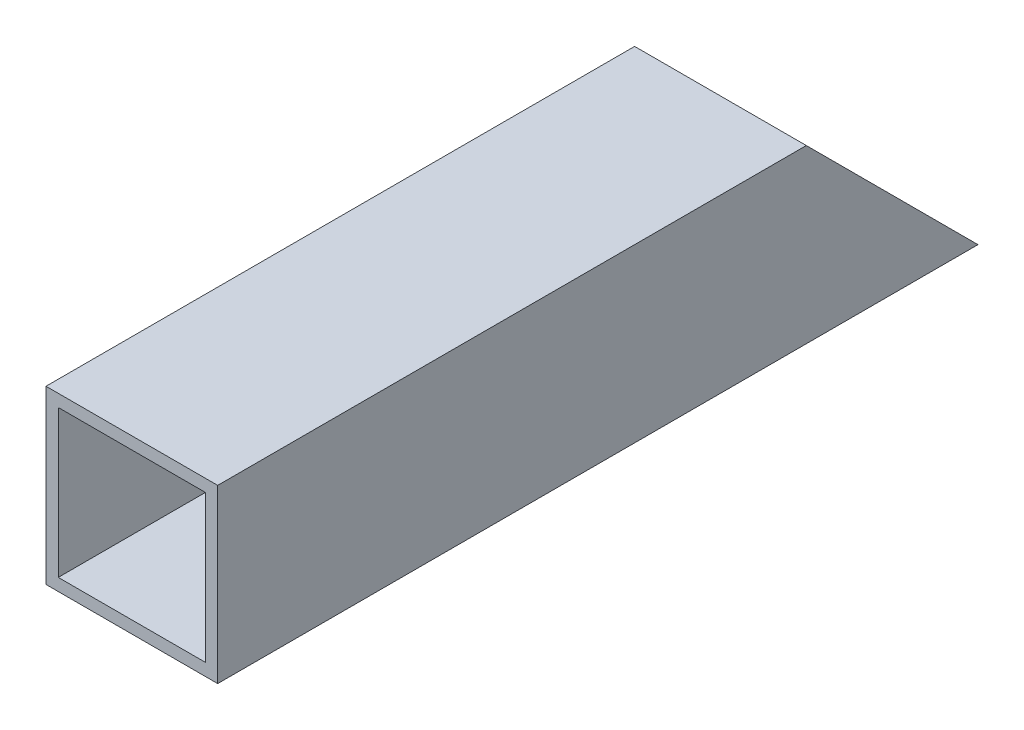
ISO-10303-21;
HEADER;
FILE_DESCRIPTION(('STEP AP214'),'2;1');
FILE_NAME('part.step','',(''),(''),'','','');
FILE_SCHEMA(('AUTOMOTIVE_DESIGN { 1 0 10303 214 1 1 1 1 }'));
ENDSEC;
DATA;
#1=APPLICATION_CONTEXT('core data for automotive mechanical design processes');
#2=APPLICATION_PROTOCOL_DEFINITION('international standard','automotive_design',2000,#1);
#3=PRODUCT_CONTEXT('',#1,'mechanical');
#4=PRODUCT('Part','Part','',(#3));
#5=PRODUCT_RELATED_PRODUCT_CATEGORY('part','',(#4));
#6=PRODUCT_DEFINITION_FORMATION('','',#4);
#7=PRODUCT_DEFINITION_CONTEXT('part definition',#1,'design');
#8=PRODUCT_DEFINITION('design','',#6,#7);
#9=PRODUCT_DEFINITION_SHAPE('','',#8);
#10=(LENGTH_UNIT() NAMED_UNIT(*) SI_UNIT(.MILLI.,.METRE.));
#11=(NAMED_UNIT(*) PLANE_ANGLE_UNIT() SI_UNIT($,.RADIAN.));
#12=(NAMED_UNIT(*) SI_UNIT($,.STERADIAN.) SOLID_ANGLE_UNIT());
#13=UNCERTAINTY_MEASURE_WITH_UNIT(LENGTH_MEASURE(1.E-05),#10,'distance_accuracy_value','');
#14=(GEOMETRIC_REPRESENTATION_CONTEXT(3) GLOBAL_UNCERTAINTY_ASSIGNED_CONTEXT((#13)) GLOBAL_UNIT_ASSIGNED_CONTEXT((#10,
#11,#12)) REPRESENTATION_CONTEXT('',''));
#15=CARTESIAN_POINT('',(0.,0.,0.));
#16=DIRECTION('',(0.,0.,1.));
#17=DIRECTION('',(1.,0.,0.));
#18=AXIS2_PLACEMENT_3D('',#15,#16,#17);
#19=CARTESIAN_POINT('',(-27.4241630678852,-17.7321151335803,0.));
#20=DIRECTION('',(-1.,0.,0.));
#21=DIRECTION('',(0.,0.,1.));
#22=AXIS2_PLACEMENT_3D('',#19,#20,#21);
#23=PLANE('',#22);
#24=DIRECTION('',(0.,1.,0.));
#25=VECTOR('',#24,1.);
#26=CARTESIAN_POINT('',(-27.4241630678852,4.49288486641971,196.85));
#27=LINE('',#26,#25);
#28=CARTESIAN_POINT('',(-27.4241630678852,-14.5571151335803,196.85));
#29=VERTEX_POINT('',#28);
#30=CARTESIAN_POINT('',(-27.4241630678852,23.5428848664197,196.85));
#31=VERTEX_POINT('',#30);
#32=EDGE_CURVE('E117',#29,#31,#27,.T.);
#33=ORIENTED_EDGE('',*,*,#32,.F.);
#34=DIRECTION('',(0.,0.,-1.));
#35=VECTOR('',#34,1.);
#36=CARTESIAN_POINT('',(-27.4241630678852,-14.5571151335803,0.));
#37=LINE('',#36,#35);
#38=CARTESIAN_POINT('',(-27.4241630678852,-14.5571151335803,3.17499999999993));
#39=VERTEX_POINT('',#38);
#40=EDGE_CURVE('E101',#29,#39,#37,.T.);
#41=ORIENTED_EDGE('',*,*,#40,.T.);
#42=DIRECTION('',(0.,-0.707106781186547,-0.707106781186548));
#43=VECTOR('',#42,1.);
#44=CARTESIAN_POINT('',(-27.4241630678852,26.7178848664198,44.45));
#45=LINE('',#44,#43);
#46=CARTESIAN_POINT('',(-27.4241630678852,23.5428848664197,41.275));
#47=VERTEX_POINT('',#46);
#48=EDGE_CURVE('E105',#39,#47,#45,.F.);
#49=ORIENTED_EDGE('',*,*,#48,.T.);
#50=DIRECTION('',(0.,0.,1.));
#51=VECTOR('',#50,1.);
#52=CARTESIAN_POINT('',(-27.4241630678852,23.5428848664197,0.));
#53=LINE('',#52,#51);
#54=EDGE_CURVE('E20',#47,#31,#53,.T.);
#55=ORIENTED_EDGE('',*,*,#54,.T.);
#56=EDGE_LOOP('',(#33,#41,#49,#55));
#57=FACE_BOUND('',#56,.T.);
#58=ADVANCED_FACE('F17',(#57),#23,.F.);
#59=CARTESIAN_POINT('',(-30.5991630678852,23.5428848664197,0.));
#60=DIRECTION('',(0.,1.,0.));
#61=DIRECTION('',(0.,0.,1.));
#62=AXIS2_PLACEMENT_3D('',#59,#60,#61);
#63=PLANE('',#62);
#64=DIRECTION('',(1.,0.,0.));
#65=VECTOR('',#64,1.);
#66=CARTESIAN_POINT('',(-8.3741630678852,23.5428848664197,196.85));
#67=LINE('',#66,#65);
#68=CARTESIAN_POINT('',(10.6758369321148,23.5428848664197,196.85));
#69=VERTEX_POINT('',#68);
#70=EDGE_CURVE('E119',#31,#69,#67,.T.);
#71=ORIENTED_EDGE('',*,*,#70,.F.);
#72=ORIENTED_EDGE('',*,*,#54,.F.);
#73=DIRECTION('',(1.,0.,0.));
#74=VECTOR('',#73,1.);
#75=CARTESIAN_POINT('',(13.8508369321148,23.5428848664198,41.2749999999999));
#76=LINE('',#75,#74);
#77=CARTESIAN_POINT('',(10.6758369321148,23.5428848664197,41.275));
#78=VERTEX_POINT('',#77);
#79=EDGE_CURVE('E107',#47,#78,#76,.T.);
#80=ORIENTED_EDGE('',*,*,#79,.T.);
#81=DIRECTION('',(0.,0.,-1.));
#82=VECTOR('',#81,1.);
#83=CARTESIAN_POINT('',(10.6758369321148,23.5428848664197,0.));
#84=LINE('',#83,#82);
#85=EDGE_CURVE('E79',#78,#69,#84,.F.);
#86=ORIENTED_EDGE('',*,*,#85,.T.);
#87=EDGE_LOOP('',(#71,#72,#80,#86));
#88=FACE_BOUND('',#87,.T.);
#89=ADVANCED_FACE('F120',(#88),#63,.F.);
#90=CARTESIAN_POINT('',(10.6758369321148,26.7178848664198,0.));
#91=DIRECTION('',(1.,0.,0.));
#92=DIRECTION('',(0.,0.,-1.));
#93=AXIS2_PLACEMENT_3D('',#90,#91,#92);
#94=PLANE('',#93);
#95=DIRECTION('',(0.,1.,0.));
#96=VECTOR('',#95,1.);
#97=CARTESIAN_POINT('',(10.6758369321148,4.49288486641971,196.85));
#98=LINE('',#97,#96);
#99=CARTESIAN_POINT('',(10.6758369321148,-14.5571151335803,196.85));
#100=VERTEX_POINT('',#99);
#101=EDGE_CURVE('E122',#69,#100,#98,.F.);
#102=ORIENTED_EDGE('',*,*,#101,.F.);
#103=ORIENTED_EDGE('',*,*,#85,.F.);
#104=DIRECTION('',(0.,-0.707106781186547,-0.707106781186548));
#105=VECTOR('',#104,1.);
#106=CARTESIAN_POINT('',(10.6758369321148,26.7178848664198,44.45));
#107=LINE('',#106,#105);
#108=CARTESIAN_POINT('',(10.6758369321148,-14.5571151335803,3.17499999999992));
#109=VERTEX_POINT('',#108);
#110=EDGE_CURVE('E82',#78,#109,#107,.T.);
#111=ORIENTED_EDGE('',*,*,#110,.T.);
#112=DIRECTION('',(0.,0.,-1.));
#113=VECTOR('',#112,1.);
#114=CARTESIAN_POINT('',(10.6758369321148,-14.5571151335803,0.));
#115=LINE('',#114,#113);
#116=EDGE_CURVE('E85',#109,#100,#115,.F.);
#117=ORIENTED_EDGE('',*,*,#116,.T.);
#118=EDGE_LOOP('',(#102,#103,#111,#117));
#119=FACE_BOUND('',#118,.T.);
#120=ADVANCED_FACE('F84',(#119),#94,.F.);
#121=CARTESIAN_POINT('',(13.8508369321148,-14.5571151335803,0.));
#122=DIRECTION('',(0.,-1.,0.));
#123=DIRECTION('',(0.,0.,-1.));
#124=AXIS2_PLACEMENT_3D('',#121,#122,#123);
#125=PLANE('',#124);
#126=DIRECTION('',(1.,0.,0.));
#127=VECTOR('',#126,1.);
#128=CARTESIAN_POINT('',(-8.3741630678852,-14.5571151335803,196.85));
#129=LINE('',#128,#127);
#130=EDGE_CURVE('E99',#100,#29,#129,.F.);
#131=ORIENTED_EDGE('',*,*,#130,.F.);
#132=ORIENTED_EDGE('',*,*,#116,.F.);
#133=DIRECTION('',(1.,0.,0.));
#134=VECTOR('',#133,1.);
#135=CARTESIAN_POINT('',(13.8508369321148,-14.5571151335803,3.17499999999989));
#136=LINE('',#135,#134);
#137=EDGE_CURVE('E90',#109,#39,#136,.F.);
#138=ORIENTED_EDGE('',*,*,#137,.T.);
#139=ORIENTED_EDGE('',*,*,#40,.F.);
#140=EDGE_LOOP('',(#131,#132,#138,#139));
#141=FACE_BOUND('',#140,.T.);
#142=ADVANCED_FACE('F95',(#141),#125,.F.);
#143=CARTESIAN_POINT('',(-30.5991630678852,26.7178848664198,0.));
#144=DIRECTION('',(0.,1.,0.));
#145=DIRECTION('',(0.,0.,1.));
#146=AXIS2_PLACEMENT_3D('',#143,#144,#145);
#147=PLANE('',#146);
#148=DIRECTION('',(1.,0.,0.));
#149=VECTOR('',#148,1.);
#150=CARTESIAN_POINT('',(13.8508369321148,26.7178848664198,44.45));
#151=LINE('',#150,#149);
#152=CARTESIAN_POINT('',(13.8508369321148,26.7178848664198,44.45));
#153=VERTEX_POINT('',#152);
#154=CARTESIAN_POINT('',(-30.5991630678852,26.7178848664198,44.45));
#155=VERTEX_POINT('',#154);
#156=EDGE_CURVE('E91',#153,#155,#151,.F.);
#157=ORIENTED_EDGE('',*,*,#156,.T.);
#158=DIRECTION('',(0.,0.,1.));
#159=VECTOR('',#158,1.);
#160=CARTESIAN_POINT('',(-30.5991630678852,26.7178848664198,0.));
#161=LINE('',#160,#159);
#162=CARTESIAN_POINT('',(-30.5991630678852,26.7178848664198,196.85));
#163=VERTEX_POINT('',#162);
#164=EDGE_CURVE('E153',#163,#155,#161,.F.);
#165=ORIENTED_EDGE('',*,*,#164,.F.);
#166=DIRECTION('',(1.,0.,0.));
#167=VECTOR('',#166,1.);
#168=CARTESIAN_POINT('',(-8.3741630678852,26.7178848664198,196.85));
#169=LINE('',#168,#167);
#170=CARTESIAN_POINT('',(13.8508369321148,26.7178848664198,196.85));
#171=VERTEX_POINT('',#170);
#172=EDGE_CURVE('E125',#171,#163,#169,.F.);
#173=ORIENTED_EDGE('',*,*,#172,.F.);
#174=DIRECTION('',(0.,0.,-1.));
#175=VECTOR('',#174,1.);
#176=CARTESIAN_POINT('',(13.8508369321148,26.7178848664198,0.));
#177=LINE('',#176,#175);
#178=EDGE_CURVE('E133',#153,#171,#177,.F.);
#179=ORIENTED_EDGE('',*,*,#178,.F.);
#180=EDGE_LOOP('',(#157,#165,#173,#179));
#181=FACE_BOUND('',#180,.T.);
#182=ADVANCED_FACE('F152',(#181),#147,.T.);
#183=CARTESIAN_POINT('',(13.8508369321148,26.7178848664198,44.45));
#184=DIRECTION('',(0.,-0.707106781186548,0.707106781186547));
#185=DIRECTION('',(0.,-0.707106781186547,-0.707106781186548));
#186=AXIS2_PLACEMENT_3D('',#183,#184,#185);
#187=PLANE('',#186);
#188=ORIENTED_EDGE('',*,*,#48,.F.);
#189=ORIENTED_EDGE('',*,*,#137,.F.);
#190=ORIENTED_EDGE('',*,*,#110,.F.);
#191=ORIENTED_EDGE('',*,*,#79,.F.);
#192=EDGE_LOOP('',(#188,#189,#190,#191));
#193=FACE_BOUND('',#192,.T.);
#194=DIRECTION('',(0.,0.707106781186547,0.707106781186548));
#195=VECTOR('',#194,1.);
#196=CARTESIAN_POINT('',(13.8508369321148,-17.7321151335802,0.));
#197=LINE('',#196,#195);
#198=CARTESIAN_POINT('',(13.8508369321148,-17.7321151335803,-1.03245884064407E-13));
#199=VERTEX_POINT('',#198);
#200=EDGE_CURVE('E135',#199,#153,#197,.T.);
#201=ORIENTED_EDGE('',*,*,#200,.F.);
#202=DIRECTION('',(1.,0.,0.));
#203=VECTOR('',#202,1.);
#204=CARTESIAN_POINT('',(13.8508369321148,-17.7321151335803,0.));
#205=LINE('',#204,#203);
#206=CARTESIAN_POINT('',(-30.5991630678852,-17.7321151335803,0.));
#207=VERTEX_POINT('',#206);
#208=EDGE_CURVE('E146',#207,#199,#205,.T.);
#209=ORIENTED_EDGE('',*,*,#208,.F.);
#210=DIRECTION('',(0.,-0.707106781186548,-0.707106781186547));
#211=VECTOR('',#210,1.);
#212=CARTESIAN_POINT('',(-30.5991630678852,26.7178848664198,44.45));
#213=LINE('',#212,#211);
#214=EDGE_CURVE('E148',#155,#207,#213,.T.);
#215=ORIENTED_EDGE('',*,*,#214,.F.);
#216=ORIENTED_EDGE('',*,*,#156,.F.);
#217=EDGE_LOOP('',(#201,#209,#215,#216));
#218=FACE_BOUND('',#217,.T.);
#219=ADVANCED_FACE('F103',(#193,#218),#187,.F.);
#220=CARTESIAN_POINT('',(13.8508369321148,26.7178848664198,0.));
#221=DIRECTION('',(1.,0.,0.));
#222=DIRECTION('',(0.,0.,-1.));
#223=AXIS2_PLACEMENT_3D('',#220,#221,#222);
#224=PLANE('',#223);
#225=ORIENTED_EDGE('',*,*,#200,.T.);
#226=ORIENTED_EDGE('',*,*,#178,.T.);
#227=DIRECTION('',(0.,1.,0.));
#228=VECTOR('',#227,1.);
#229=CARTESIAN_POINT('',(13.8508369321148,4.49288486641971,196.85));
#230=LINE('',#229,#228);
#231=CARTESIAN_POINT('',(13.8508369321148,-17.7321151335803,196.85));
#232=VERTEX_POINT('',#231);
#233=EDGE_CURVE('E127',#232,#171,#230,.T.);
#234=ORIENTED_EDGE('',*,*,#233,.F.);
#235=DIRECTION('',(0.,0.,-1.));
#236=VECTOR('',#235,1.);
#237=CARTESIAN_POINT('',(13.8508369321148,-17.7321151335803,0.));
#238=LINE('',#237,#236);
#239=EDGE_CURVE('E143',#199,#232,#238,.F.);
#240=ORIENTED_EDGE('',*,*,#239,.F.);
#241=EDGE_LOOP('',(#225,#226,#234,#240));
#242=FACE_BOUND('',#241,.T.);
#243=ADVANCED_FACE('F139',(#242),#224,.T.);
#244=CARTESIAN_POINT('',(-8.3741630678852,4.49288486641971,196.85));
#245=DIRECTION('',(0.,0.,1.));
#246=DIRECTION('',(1.,0.,0.));
#247=AXIS2_PLACEMENT_3D('',#244,#245,#246);
#248=PLANE('',#247);
#249=ORIENTED_EDGE('',*,*,#101,.T.);
#250=ORIENTED_EDGE('',*,*,#130,.T.);
#251=ORIENTED_EDGE('',*,*,#32,.T.);
#252=ORIENTED_EDGE('',*,*,#70,.T.);
#253=EDGE_LOOP('',(#249,#250,#251,#252));
#254=FACE_BOUND('',#253,.T.);
#255=ORIENTED_EDGE('',*,*,#233,.T.);
#256=ORIENTED_EDGE('',*,*,#172,.T.);
#257=DIRECTION('',(0.,1.,0.));
#258=VECTOR('',#257,1.);
#259=CARTESIAN_POINT('',(-30.5991630678852,-17.7321151335803,196.85));
#260=LINE('',#259,#258);
#261=CARTESIAN_POINT('',(-30.5991630678852,-17.7321151335803,196.85));
#262=VERTEX_POINT('',#261);
#263=EDGE_CURVE('E35',#262,#163,#260,.T.);
#264=ORIENTED_EDGE('',*,*,#263,.F.);
#265=DIRECTION('',(1.,0.,0.));
#266=VECTOR('',#265,1.);
#267=CARTESIAN_POINT('',(13.8508369321148,-17.7321151335803,196.85));
#268=LINE('',#267,#266);
#269=EDGE_CURVE('E26',#232,#262,#268,.F.);
#270=ORIENTED_EDGE('',*,*,#269,.F.);
#271=EDGE_LOOP('',(#255,#256,#264,#270));
#272=FACE_BOUND('',#271,.T.);
#273=ADVANCED_FACE('F124',(#254,#272),#248,.T.);
#274=CARTESIAN_POINT('',(-30.5991630678852,-17.7321151335803,0.));
#275=DIRECTION('',(-1.,0.,0.));
#276=DIRECTION('',(0.,0.,1.));
#277=AXIS2_PLACEMENT_3D('',#274,#275,#276);
#278=PLANE('',#277);
#279=ORIENTED_EDGE('',*,*,#214,.T.);
#280=DIRECTION('',(0.,0.,-1.));
#281=VECTOR('',#280,1.);
#282=CARTESIAN_POINT('',(-30.5991630678852,-17.7321151335803,0.));
#283=LINE('',#282,#281);
#284=EDGE_CURVE('E11',#262,#207,#283,.T.);
#285=ORIENTED_EDGE('',*,*,#284,.F.);
#286=ORIENTED_EDGE('',*,*,#263,.T.);
#287=ORIENTED_EDGE('',*,*,#164,.T.);
#288=EDGE_LOOP('',(#279,#285,#286,#287));
#289=FACE_BOUND('',#288,.T.);
#290=ADVANCED_FACE('F165',(#289),#278,.T.);
#291=CARTESIAN_POINT('',(13.8508369321148,-17.7321151335803,0.));
#292=DIRECTION('',(0.,-1.,0.));
#293=DIRECTION('',(0.,0.,-1.));
#294=AXIS2_PLACEMENT_3D('',#291,#292,#293);
#295=PLANE('',#294);
#296=ORIENTED_EDGE('',*,*,#269,.T.);
#297=ORIENTED_EDGE('',*,*,#284,.T.);
#298=ORIENTED_EDGE('',*,*,#208,.T.);
#299=ORIENTED_EDGE('',*,*,#239,.T.);
#300=EDGE_LOOP('',(#296,#297,#298,#299));
#301=FACE_BOUND('',#300,.T.);
#302=ADVANCED_FACE('F157',(#301),#295,.T.);
#303=CLOSED_SHELL('',(#58,#89,#120,#142,#182,#219,#243,#273,#290,#302));
#304=MANIFOLD_SOLID_BREP('B1',#303);
#305=ADVANCED_BREP_SHAPE_REPRESENTATION('',(#18,#304),#14);
#306=SHAPE_DEFINITION_REPRESENTATION(#9,#305);
ENDSEC;
END-ISO-10303-21;
